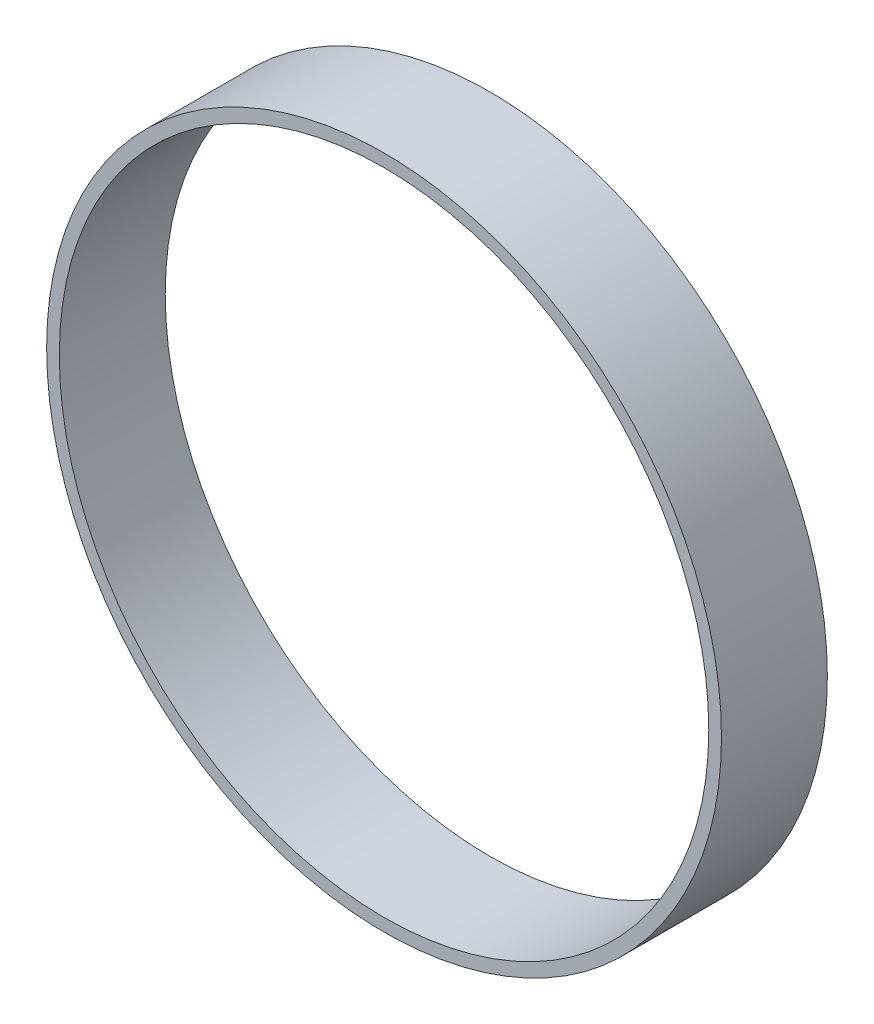
ISO-10303-21;
HEADER;
FILE_DESCRIPTION(('STEP AP214'),'2;1');
FILE_NAME('part.step','',(''),(''),'','','');
FILE_SCHEMA(('AUTOMOTIVE_DESIGN { 1 0 10303 214 1 1 1 1 }'));
ENDSEC;
DATA;
#1=APPLICATION_CONTEXT('core data for automotive mechanical design processes');
#2=APPLICATION_PROTOCOL_DEFINITION('international standard','automotive_design',2000,#1);
#3=PRODUCT_CONTEXT('',#1,'mechanical');
#4=PRODUCT('Part','Part','',(#3));
#5=PRODUCT_RELATED_PRODUCT_CATEGORY('part','',(#4));
#6=PRODUCT_DEFINITION_FORMATION('','',#4);
#7=PRODUCT_DEFINITION_CONTEXT('part definition',#1,'design');
#8=PRODUCT_DEFINITION('design','',#6,#7);
#9=PRODUCT_DEFINITION_SHAPE('','',#8);
#10=(LENGTH_UNIT() NAMED_UNIT(*) SI_UNIT(.MILLI.,.METRE.));
#11=(NAMED_UNIT(*) PLANE_ANGLE_UNIT() SI_UNIT($,.RADIAN.));
#12=(NAMED_UNIT(*) SI_UNIT($,.STERADIAN.) SOLID_ANGLE_UNIT());
#13=UNCERTAINTY_MEASURE_WITH_UNIT(LENGTH_MEASURE(1.E-05),#10,'distance_accuracy_value','');
#14=(GEOMETRIC_REPRESENTATION_CONTEXT(3) GLOBAL_UNCERTAINTY_ASSIGNED_CONTEXT((#13)) GLOBAL_UNIT_ASSIGNED_CONTEXT((#10,
#11,#12)) REPRESENTATION_CONTEXT('',''));
#15=CARTESIAN_POINT('',(0.,0.,0.));
#16=DIRECTION('',(0.,0.,1.));
#17=DIRECTION('',(1.,0.,0.));
#18=AXIS2_PLACEMENT_3D('',#15,#16,#17);
#19=CARTESIAN_POINT('',(-117.46111430766,21.0768251273345,15.));
#20=DIRECTION('',(0.,0.,1.));
#21=DIRECTION('',(1.,0.,0.));
#22=AXIS2_PLACEMENT_3D('',#19,#20,#21);
#23=PLANE('',#22);
#24=CARTESIAN_POINT('',(-117.46111430766,21.0768251273345,15.));
#25=DIRECTION('',(0.,0.,1.));
#26=DIRECTION('',(1.,0.,0.));
#27=AXIS2_PLACEMENT_3D('',#24,#25,#26);
#28=CIRCLE('',#27,47.8);
#29=CARTESIAN_POINT('',(-69.6611143076605,21.0768251273345,15.));
#30=VERTEX_POINT('',#29);
#31=EDGE_CURVE('E10',#30,#30,#28,.T.);
#32=ORIENTED_EDGE('',*,*,#31,.T.);
#33=EDGE_LOOP('',(#32));
#34=FACE_BOUND('',#33,.T.);
#35=CARTESIAN_POINT('',(-117.46111430766,21.0768251273345,15.));
#36=DIRECTION('',(0.,0.,1.));
#37=DIRECTION('',(1.,0.,0.));
#38=AXIS2_PLACEMENT_3D('',#35,#36,#37);
#39=CIRCLE('',#38,46.);
#40=CARTESIAN_POINT('',(-71.4611143076605,21.0768251273345,15.));
#41=VERTEX_POINT('',#40);
#42=EDGE_CURVE('E42',#41,#41,#39,.T.);
#43=ORIENTED_EDGE('',*,*,#42,.F.);
#44=EDGE_LOOP('',(#43));
#45=FACE_BOUND('',#44,.T.);
#46=ADVANCED_FACE('F31',(#34,#45),#23,.T.);
#47=CARTESIAN_POINT('',(-117.46111430766,21.0768251273345,0.));
#48=DIRECTION('',(0.,0.,1.));
#49=DIRECTION('',(1.,0.,0.));
#50=AXIS2_PLACEMENT_3D('',#47,#48,#49);
#51=PLANE('',#50);
#52=CARTESIAN_POINT('',(-117.46111430766,21.0768251273345,0.));
#53=DIRECTION('',(0.,0.,1.));
#54=DIRECTION('',(1.,0.,0.));
#55=AXIS2_PLACEMENT_3D('',#52,#53,#54);
#56=CIRCLE('',#55,47.8);
#57=CARTESIAN_POINT('',(-69.6611143076605,21.0768251273345,0.));
#58=VERTEX_POINT('',#57);
#59=EDGE_CURVE('E35',#58,#58,#56,.T.);
#60=ORIENTED_EDGE('',*,*,#59,.F.);
#61=EDGE_LOOP('',(#60));
#62=FACE_BOUND('',#61,.T.);
#63=CARTESIAN_POINT('',(-117.46111430766,21.0768251273345,0.));
#64=DIRECTION('',(0.,0.,1.));
#65=DIRECTION('',(1.,0.,0.));
#66=AXIS2_PLACEMENT_3D('',#63,#64,#65);
#67=CIRCLE('',#66,46.);
#68=CARTESIAN_POINT('',(-71.4611143076605,21.0768251273345,0.));
#69=VERTEX_POINT('',#68);
#70=EDGE_CURVE('E44',#69,#69,#67,.T.);
#71=ORIENTED_EDGE('',*,*,#70,.T.);
#72=EDGE_LOOP('',(#71));
#73=FACE_BOUND('',#72,.T.);
#74=ADVANCED_FACE('F54',(#62,#73),#51,.F.);
#75=CARTESIAN_POINT('',(-117.46111430766,21.0768251273345,15.));
#76=DIRECTION('',(0.,0.,-1.));
#77=DIRECTION('',(-1.,0.,0.));
#78=AXIS2_PLACEMENT_3D('',#75,#76,#77);
#79=CYLINDRICAL_SURFACE('',#78,47.8);
#80=ORIENTED_EDGE('',*,*,#31,.F.);
#81=EDGE_LOOP('',(#80));
#82=FACE_BOUND('',#81,.T.);
#83=ORIENTED_EDGE('',*,*,#59,.T.);
#84=EDGE_LOOP('',(#83));
#85=FACE_BOUND('',#84,.T.);
#86=ADVANCED_FACE('F33',(#82,#85),#79,.T.);
#87=CARTESIAN_POINT('',(-117.46111430766,21.0768251273345,15.));
#88=DIRECTION('',(0.,0.,-1.));
#89=DIRECTION('',(-1.,0.,0.));
#90=AXIS2_PLACEMENT_3D('',#87,#88,#89);
#91=CYLINDRICAL_SURFACE('',#90,46.);
#92=ORIENTED_EDGE('',*,*,#42,.T.);
#93=EDGE_LOOP('',(#92));
#94=FACE_BOUND('',#93,.T.);
#95=ORIENTED_EDGE('',*,*,#70,.F.);
#96=EDGE_LOOP('',(#95));
#97=FACE_BOUND('',#96,.T.);
#98=ADVANCED_FACE('F50',(#94,#97),#91,.F.);
#99=CLOSED_SHELL('',(#46,#74,#86,#98));
#100=MANIFOLD_SOLID_BREP('B2',#99);
#101=ADVANCED_BREP_SHAPE_REPRESENTATION('',(#18,#100),#14);
#102=SHAPE_DEFINITION_REPRESENTATION(#9,#101);
ENDSEC;
END-ISO-10303-21;
